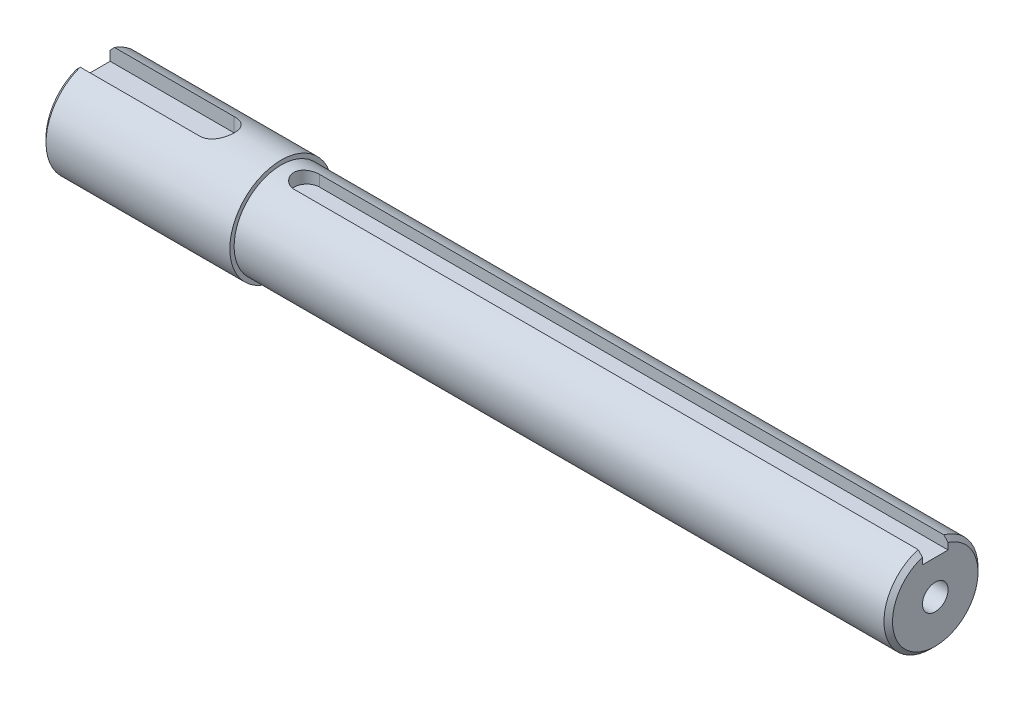
ISO-10303-21;
HEADER;
FILE_DESCRIPTION(('STEP AP214'),'2;1');
FILE_NAME('part.step','',(''),(''),'','','');
FILE_SCHEMA(('AUTOMOTIVE_DESIGN { 1 0 10303 214 1 1 1 1 }'));
ENDSEC;
DATA;
#1=APPLICATION_CONTEXT('core data for automotive mechanical design processes');
#2=APPLICATION_PROTOCOL_DEFINITION('international standard','automotive_design',2000,#1);
#3=PRODUCT_CONTEXT('',#1,'mechanical');
#4=PRODUCT('Part','Part','',(#3));
#5=PRODUCT_RELATED_PRODUCT_CATEGORY('part','',(#4));
#6=PRODUCT_DEFINITION_FORMATION('','',#4);
#7=PRODUCT_DEFINITION_CONTEXT('part definition',#1,'design');
#8=PRODUCT_DEFINITION('design','',#6,#7);
#9=PRODUCT_DEFINITION_SHAPE('','',#8);
#10=(LENGTH_UNIT() NAMED_UNIT(*) SI_UNIT(.MILLI.,.METRE.));
#11=(NAMED_UNIT(*) PLANE_ANGLE_UNIT() SI_UNIT($,.RADIAN.));
#12=(NAMED_UNIT(*) SI_UNIT($,.STERADIAN.) SOLID_ANGLE_UNIT());
#13=UNCERTAINTY_MEASURE_WITH_UNIT(LENGTH_MEASURE(1.E-05),#10,'distance_accuracy_value','');
#14=(GEOMETRIC_REPRESENTATION_CONTEXT(3) GLOBAL_UNCERTAINTY_ASSIGNED_CONTEXT((#13)) GLOBAL_UNIT_ASSIGNED_CONTEXT((#10,
#11,#12)) REPRESENTATION_CONTEXT('',''));
#15=CARTESIAN_POINT('',(0.,0.,0.));
#16=DIRECTION('',(0.,0.,1.));
#17=DIRECTION('',(1.,0.,0.));
#18=AXIS2_PLACEMENT_3D('',#15,#16,#17);
#19=CARTESIAN_POINT('',(0.,11.,0.));
#20=DIRECTION('',(1.,0.,0.));
#21=DIRECTION('',(0.,1.,0.));
#22=AXIS2_PLACEMENT_3D('',#19,#20,#21);
#23=PLANE('',#22);
#24=CARTESIAN_POINT('',(0.,0.,0.));
#25=DIRECTION('',(1.,0.,0.));
#26=DIRECTION('',(0.,1.,0.));
#27=AXIS2_PLACEMENT_3D('',#24,#25,#26);
#28=CIRCLE('',#27,3.);
#29=CARTESIAN_POINT('',(0.,3.,0.));
#30=VERTEX_POINT('',#29);
#31=EDGE_CURVE('E142',#30,#30,#28,.T.);
#32=ORIENTED_EDGE('',*,*,#31,.F.);
#33=EDGE_LOOP('',(#32));
#34=FACE_BOUND('',#33,.T.);
#35=DIRECTION('',(0.,1.,0.));
#36=VECTOR('',#35,1.);
#37=CARTESIAN_POINT('',(0.,8.00000000000001,3.00000000000002));
#38=LINE('',#37,#36);
#39=CARTESIAN_POINT('',(0.,8.00000000000001,3.00000000000002));
#40=VERTEX_POINT('',#39);
#41=CARTESIAN_POINT('',(0.,9.53939201416943,3.00000000000002));
#42=VERTEX_POINT('',#41);
#43=EDGE_CURVE('E126',#40,#42,#38,.T.);
#44=ORIENTED_EDGE('',*,*,#43,.T.);
#45=CARTESIAN_POINT('',(0.,0.,0.));
#46=DIRECTION('',(1.,0.,0.));
#47=DIRECTION('',(0.,1.,0.));
#48=AXIS2_PLACEMENT_3D('',#45,#46,#47);
#49=CIRCLE('',#48,9.99999999999998);
#50=CARTESIAN_POINT('',(0.,9.53939201416944,-2.99999999999998));
#51=VERTEX_POINT('',#50);
#52=EDGE_CURVE('E311',#42,#51,#49,.T.);
#53=ORIENTED_EDGE('',*,*,#52,.T.);
#54=DIRECTION('',(0.,1.,0.));
#55=VECTOR('',#54,1.);
#56=CARTESIAN_POINT('',(0.,8.00000000000001,-2.99999999999998));
#57=LINE('',#56,#55);
#58=CARTESIAN_POINT('',(0.,8.00000000000001,-2.99999999999998));
#59=VERTEX_POINT('',#58);
#60=EDGE_CURVE('E151',#59,#51,#57,.T.);
#61=ORIENTED_EDGE('',*,*,#60,.F.);
#62=DIRECTION('',(0.,0.,-1.));
#63=VECTOR('',#62,1.);
#64=CARTESIAN_POINT('',(0.,8.00000000000001,3.00000000000002));
#65=LINE('',#64,#63);
#66=EDGE_CURVE('E135',#40,#59,#65,.T.);
#67=ORIENTED_EDGE('',*,*,#66,.F.);
#68=EDGE_LOOP('',(#44,#53,#61,#67));
#69=FACE_BOUND('',#68,.T.);
#70=ADVANCED_FACE('F32',(#34,#69),#23,.T.);
#71=CARTESIAN_POINT('',(-197.,0.,0.));
#72=DIRECTION('',(-1.,0.,0.));
#73=DIRECTION('',(0.,-1.,0.));
#74=AXIS2_PLACEMENT_3D('',#71,#72,#73);
#75=PLANE('',#74);
#76=DIRECTION('',(0.,1.,0.));
#77=VECTOR('',#76,1.);
#78=CARTESIAN_POINT('',(-197.,7.99999999999997,-4.));
#79=LINE('',#78,#77);
#80=CARTESIAN_POINT('',(-197.,7.99999999999997,-4.));
#81=VERTEX_POINT('',#80);
#82=CARTESIAN_POINT('',(-197.,10.2469507659596,-4.));
#83=VERTEX_POINT('',#82);
#84=EDGE_CURVE('E172',#81,#83,#79,.T.);
#85=ORIENTED_EDGE('',*,*,#84,.T.);
#86=CARTESIAN_POINT('',(-197.,0.,0.));
#87=DIRECTION('',(-1.,0.,0.));
#88=DIRECTION('',(0.,-1.,0.));
#89=AXIS2_PLACEMENT_3D('',#86,#87,#88);
#90=CIRCLE('',#89,11.);
#91=CARTESIAN_POINT('',(-197.,10.2469507659596,4.));
#92=VERTEX_POINT('',#91);
#93=EDGE_CURVE('E46',#83,#92,#90,.T.);
#94=ORIENTED_EDGE('',*,*,#93,.T.);
#95=DIRECTION('',(0.,1.,0.));
#96=VECTOR('',#95,1.);
#97=CARTESIAN_POINT('',(-197.,7.99999999999997,4.));
#98=LINE('',#97,#96);
#99=CARTESIAN_POINT('',(-197.,7.99999999999997,4.));
#100=VERTEX_POINT('',#99);
#101=EDGE_CURVE('E170',#100,#92,#98,.T.);
#102=ORIENTED_EDGE('',*,*,#101,.F.);
#103=DIRECTION('',(0.,0.,1.));
#104=VECTOR('',#103,1.);
#105=CARTESIAN_POINT('',(-197.,7.99999999999997,-4.));
#106=LINE('',#105,#104);
#107=EDGE_CURVE('E160',#81,#100,#106,.T.);
#108=ORIENTED_EDGE('',*,*,#107,.F.);
#109=EDGE_LOOP('',(#85,#94,#102,#108));
#110=FACE_BOUND('',#109,.T.);
#111=ADVANCED_FACE('F236',(#110),#75,.T.);
#112=CARTESIAN_POINT('',(0.,0.,0.));
#113=DIRECTION('',(1.,0.,0.));
#114=DIRECTION('',(0.,1.,0.));
#115=AXIS2_PLACEMENT_3D('',#112,#113,#114);
#116=CYLINDRICAL_SURFACE('',#115,12.);
#117=DIRECTION('',(1.,0.,0.));
#118=VECTOR('',#117,1.);
#119=CARTESIAN_POINT('',(0.,11.3137084989848,4.00000000000002));
#120=LINE('',#119,#118);
#121=CARTESIAN_POINT('',(-196.,11.3137084989847,4.00000000000002));
#122=VERTEX_POINT('',#121);
#123=CARTESIAN_POINT('',(-167.997221426031,11.3137084989847,4.));
#124=VERTEX_POINT('',#123);
#125=EDGE_CURVE('E217',#122,#124,#120,.T.);
#126=ORIENTED_EDGE('',*,*,#125,.F.);
#127=CARTESIAN_POINT('',(-196.,0.,0.));
#128=DIRECTION('',(-1.,0.,0.));
#129=DIRECTION('',(0.,-1.,0.));
#130=AXIS2_PLACEMENT_3D('',#127,#128,#129);
#131=CIRCLE('',#130,12.);
#132=CARTESIAN_POINT('',(-196.,11.3137084989847,-4.));
#133=VERTEX_POINT('',#132);
#134=EDGE_CURVE('E264',#122,#133,#131,.F.);
#135=ORIENTED_EDGE('',*,*,#134,.T.);
#136=DIRECTION('',(1.,0.,0.));
#137=VECTOR('',#136,1.);
#138=CARTESIAN_POINT('',(0.,11.3137084989848,-4.));
#139=LINE('',#138,#137);
#140=CARTESIAN_POINT('',(-167.997220054122,11.3137084989847,-4.00000000000012));
#141=VERTEX_POINT('',#140);
#142=EDGE_CURVE('E189',#141,#133,#139,.F.);
#143=ORIENTED_EDGE('',*,*,#142,.F.);
#144=CARTESIAN_POINT('',(-167.997221426031,11.3137084989848,3.99999999999988));
#145=CARTESIAN_POINT('',(-167.888090106488,11.3136910791362,4.00001442319682));
#146=CARTESIAN_POINT('',(-167.778968514733,11.3152870758636,3.99553427080708));
#147=CARTESIAN_POINT('',(-167.561571775743,11.3215763327299,3.97769688383125));
#148=CARTESIAN_POINT('',(-167.453296407997,11.3262687567835,3.96434204554667));
#149=CARTESIAN_POINT('',(-167.238676651281,11.3386031917916,3.92891961679664));
#150=CARTESIAN_POINT('',(-167.132327504771,11.3462364527503,3.90687786843503));
#151=CARTESIAN_POINT('',(-166.92200818818,11.3642017894014,3.85430727682012));
#152=CARTESIAN_POINT('',(-166.818038104224,11.3745339626305,3.82377812683596));
#153=CARTESIAN_POINT('',(-166.510882856689,11.4091188790636,3.71986535194482));
#154=CARTESIAN_POINT('',(-166.312134708073,11.4369797092,3.63410327405976));
#155=CARTESIAN_POINT('',(-165.931818401872,11.4991523210461,3.43228529507635));
#156=CARTESIAN_POINT('',(-165.750260887349,11.5334680603617,3.31621079191059));
#157=CARTESIAN_POINT('',(-165.402352538126,11.6061786650499,3.05220889302921));
#158=CARTESIAN_POINT('',(-165.236764909265,11.6446747732985,2.90330158341943));
#159=CARTESIAN_POINT('',(-164.932393668993,11.7205537706782,2.57995430206052));
#160=CARTESIAN_POINT('',(-164.793614830528,11.7579364605799,2.4055097934559));
#161=CARTESIAN_POINT('',(-164.543303680364,11.8285550675146,2.03041609586298));
#162=CARTESIAN_POINT('',(-164.432577068633,11.8616572833476,1.82920178413627));
#163=CARTESIAN_POINT('',(-164.246851348986,11.9187841776778,1.4097184045306));
#164=CARTESIAN_POINT('',(-164.171841327038,11.9428116287148,1.19145457028982));
#165=CARTESIAN_POINT('',(-164.062277497627,11.9783627494006,0.752118908884026));
#166=CARTESIAN_POINT('',(-164.026407171149,11.9902922934759,0.531408862008694));
#167=CARTESIAN_POINT('',(-163.991954886794,12.0017443244221,0.0867973729270466));
#168=CARTESIAN_POINT('',(-163.993364043943,12.0012697676144,-0.137103296130751));
#169=CARTESIAN_POINT('',(-164.03259693882,11.988241619993,-0.572413904534736));
#170=CARTESIAN_POINT('',(-164.068990168218,11.9761625522358,-0.783969302062176));
#171=CARTESIAN_POINT('',(-164.174792564208,11.941878541528,-1.19777494078103));
#172=CARTESIAN_POINT('',(-164.2442035615,11.9196730371107,-1.40002466532908));
#173=CARTESIAN_POINT('',(-164.414904312113,11.8670269953404,-1.79260892939447));
#174=CARTESIAN_POINT('',(-164.516601364248,11.8364819827225,-1.98275175570623));
#175=CARTESIAN_POINT('',(-164.748661149424,11.7703354886693,-2.34369816422615));
#176=CARTESIAN_POINT('',(-164.879031680133,11.7347326327029,-2.51449646656923));
#177=CARTESIAN_POINT('',(-165.171894784117,11.6602521397236,-2.84038438576713));
#178=CARTESIAN_POINT('',(-165.335609036658,11.6212992344639,-2.99435851004163));
#179=CARTESIAN_POINT('',(-165.687016835815,11.5458960410484,-3.27310215297859));
#180=CARTESIAN_POINT('',(-165.874718099149,11.5094465640828,-3.39786223662125));
#181=CARTESIAN_POINT('',(-166.17193162091,11.4595761865514,-3.56109686831238));
#182=CARTESIAN_POINT('',(-166.274474056641,11.4436487055863,-3.61182291509583));
#183=CARTESIAN_POINT('',(-166.483783598967,11.4140168981015,-3.70440036952381));
#184=CARTESIAN_POINT('',(-166.590548924884,11.4003116467005,-3.74625547145216));
#185=CARTESIAN_POINT('',(-166.807435663005,11.3755874850411,-3.8206738089953));
#186=CARTESIAN_POINT('',(-166.91755327838,11.3645656541855,-3.85324715338638));
#187=CARTESIAN_POINT('',(-167.14038670142,11.3455649652074,-3.90883808557055));
#188=CARTESIAN_POINT('',(-167.253101297794,11.3375847177159,-3.93186003678465));
#189=CARTESIAN_POINT('',(-167.470861227494,11.3254693804977,-3.96661946733206));
#190=CARTESIAN_POINT('',(-167.575768551931,11.3210705609195,-3.97913364995728));
#191=CARTESIAN_POINT('',(-167.786187873259,11.3151843375549,-3.99582492918761));
#192=CARTESIAN_POINT('',(-167.891698913019,11.3136931769955,-4.0000127837681));
#193=CARTESIAN_POINT('',(-167.997220054122,11.3137084989847,-4.00000000000012));
#194=B_SPLINE_CURVE_WITH_KNOTS('',3,(#144,#145,#146,#147,#148,#149,#150,#151,#152,#153,#154,
#155,#156,#157,#158,#159,#160,#161,#162,#163,#164,#165,#166,#167,#168,#169,#170,#171,#172,#173,
#174,#175,#176,#177,#178,#179,#180,#181,#182,#183,#184,#185,#186,#187,#188,#189,#190,#191,#192,
#193),.UNSPECIFIED.,.F.,.F.,(4,2,2,2,2,2,2,2,2,2,2,2,2,2,2,2,2,2,2,2,2,2,2,2,4),(0.,
0.327273924096128,0.654459515093158,0.980679042792578,1.30691036145123,1.95841618317488,
2.61032276306354,3.28524567021812,3.96028862781627,4.6529507563251,5.34540108982523,
6.01376431370868,6.68196824523135,7.32396227493038,7.96599190471041,8.61646627274796,
9.26711775459614,9.94834762149011,10.6297971971097,10.9759537837694,11.3219659298552,
11.6675997805435,12.01307555889,12.3299374424192,12.6463896599707),.UNSPECIFIED.);
#195=EDGE_CURVE('E180',#124,#141,#194,.T.);
#196=ORIENTED_EDGE('',*,*,#195,.F.);
#197=EDGE_LOOP('',(#126,#135,#143,#196));
#198=FACE_BOUND('',#197,.T.);
#199=CARTESIAN_POINT('',(-153.,0.,0.));
#200=DIRECTION('',(1.,0.,0.));
#201=DIRECTION('',(0.,1.,0.));
#202=AXIS2_PLACEMENT_3D('',#199,#200,#201);
#203=CIRCLE('',#202,12.);
#204=CARTESIAN_POINT('',(-153.,12.,0.));
#205=VERTEX_POINT('',#204);
#206=EDGE_CURVE('E177',#205,#205,#203,.T.);
#207=ORIENTED_EDGE('',*,*,#206,.F.);
#208=EDGE_LOOP('',(#207));
#209=FACE_BOUND('',#208,.T.);
#210=ADVANCED_FACE('F191',(#198,#209),#116,.T.);
#211=CARTESIAN_POINT('',(-153.,12.,0.));
#212=DIRECTION('',(1.,0.,0.));
#213=DIRECTION('',(0.,1.,0.));
#214=AXIS2_PLACEMENT_3D('',#211,#212,#213);
#215=PLANE('',#214);
#216=ORIENTED_EDGE('',*,*,#206,.T.);
#217=EDGE_LOOP('',(#216));
#218=FACE_BOUND('',#217,.T.);
#219=CARTESIAN_POINT('',(-153.,0.,0.));
#220=DIRECTION('',(1.,0.,0.));
#221=DIRECTION('',(0.,1.,0.));
#222=AXIS2_PLACEMENT_3D('',#219,#220,#221);
#223=CIRCLE('',#222,11.);
#224=CARTESIAN_POINT('',(-153.,11.,0.));
#225=VERTEX_POINT('',#224);
#226=EDGE_CURVE('E169',#225,#225,#223,.T.);
#227=ORIENTED_EDGE('',*,*,#226,.F.);
#228=EDGE_LOOP('',(#227));
#229=FACE_BOUND('',#228,.T.);
#230=ADVANCED_FACE('F207',(#218,#229),#215,.T.);
#231=CARTESIAN_POINT('',(0.,0.,0.));
#232=DIRECTION('',(1.,0.,0.));
#233=DIRECTION('',(0.,1.,0.));
#234=AXIS2_PLACEMENT_3D('',#231,#232,#233);
#235=CYLINDRICAL_SURFACE('',#234,11.);
#236=DIRECTION('',(1.,0.,0.));
#237=VECTOR('',#236,1.);
#238=CARTESIAN_POINT('',(0.,10.5830052442584,-2.99999999999998));
#239=LINE('',#238,#237);
#240=CARTESIAN_POINT('',(-1.00000000000004,10.5830052442584,-2.99999999999998));
#241=VERTEX_POINT('',#240);
#242=CARTESIAN_POINT('',(-147.,10.5830052442584,-2.99999999999998));
#243=VERTEX_POINT('',#242);
#244=EDGE_CURVE('E313',#241,#243,#239,.F.);
#245=ORIENTED_EDGE('',*,*,#244,.F.);
#246=CARTESIAN_POINT('',(-1.00000000000004,0.,0.));
#247=DIRECTION('',(1.,0.,0.));
#248=DIRECTION('',(0.,1.,0.));
#249=AXIS2_PLACEMENT_3D('',#246,#247,#248);
#250=CIRCLE('',#249,11.);
#251=CARTESIAN_POINT('',(-1.00000000000004,10.5830052442584,3.00000000000002));
#252=VERTEX_POINT('',#251);
#253=EDGE_CURVE('E265',#241,#252,#250,.F.);
#254=ORIENTED_EDGE('',*,*,#253,.T.);
#255=DIRECTION('',(1.,0.,0.));
#256=VECTOR('',#255,1.);
#257=CARTESIAN_POINT('',(0.,10.5830052442584,3.00000000000002));
#258=LINE('',#257,#256);
#259=CARTESIAN_POINT('',(-147.,10.5830052442584,3.00000000000002));
#260=VERTEX_POINT('',#259);
#261=EDGE_CURVE('E216',#260,#252,#258,.T.);
#262=ORIENTED_EDGE('',*,*,#261,.F.);
#263=CARTESIAN_POINT('',(-147.,10.5830052442584,-2.99999999999998));
#264=CARTESIAN_POINT('',(-147.08269389141,10.5829949970026,-3.00000989976807));
#265=CARTESIAN_POINT('',(-147.165381704592,10.5839742471726,-2.99658102723593));
#266=CARTESIAN_POINT('',(-147.330133566229,10.5878356752194,-2.98292268314839));
#267=CARTESIAN_POINT('',(-147.412197731629,10.5907174869552,-2.97269452008912));
#268=CARTESIAN_POINT('',(-147.574942512145,10.598299618142,-2.94554459027319));
#269=CARTESIAN_POINT('',(-147.655625789386,10.6029958951229,-2.92863770126908));
#270=CARTESIAN_POINT('',(-147.815203254054,10.6140571066224,-2.88829120712687));
#271=CARTESIAN_POINT('',(-147.894097407408,10.6204220728906,-2.86485147768948));
#272=CARTESIAN_POINT('',(-148.127242907164,10.6417494872311,-2.78500332821791));
#273=CARTESIAN_POINT('',(-148.278139394855,10.6589535681767,-2.71903526586305));
#274=CARTESIAN_POINT('',(-148.566705341769,10.6973836998985,-2.56365897700122));
#275=CARTESIAN_POINT('',(-148.704370097104,10.7186111730805,-2.47424245636569));
#276=CARTESIAN_POINT('',(-148.966209705979,10.7633148792344,-2.27200424315803));
#277=CARTESIAN_POINT('',(-149.089991878244,10.7868322128172,-2.15868225262834));
#278=CARTESIAN_POINT('',(-149.317051438905,10.8331129950831,-1.91292298422352));
#279=CARTESIAN_POINT('',(-149.420325477293,10.8558763200935,-1.7804825894445));
#280=CARTESIAN_POINT('',(-149.605098906746,10.8985459264206,-1.49749198480949));
#281=CARTESIAN_POINT('',(-149.686203079821,10.9183977479742,-1.34667477161621));
#282=CARTESIAN_POINT('',(-149.82174841378,10.9525311229674,-1.03291980522384));
#283=CARTESIAN_POINT('',(-149.876195521132,10.9668139185607,-0.869984764533379));
#284=CARTESIAN_POINT('',(-149.955601734903,10.9879090070619,-0.540744675896701));
#285=CARTESIAN_POINT('',(-149.981234326369,10.9948916417093,-0.374613167612517));
#286=CARTESIAN_POINT('',(-150.004404664847,11.0011960589752,-0.0402673813620042));
#287=CARTESIAN_POINT('',(-150.001946716178,11.0005190152883,0.12794657356471));
#288=CARTESIAN_POINT('',(-149.969475124185,10.9917041066205,0.45698092440427));
#289=CARTESIAN_POINT('',(-149.940189973227,10.9837634920705,0.6178793089181));
#290=CARTESIAN_POINT('',(-149.856074784141,10.9615477415639,0.932383527853158));
#291=CARTESIAN_POINT('',(-149.801243508315,10.9472722986892,1.085989008539));
#292=CARTESIAN_POINT('',(-149.667045133193,10.9137016176963,1.38338788045078));
#293=CARTESIAN_POINT('',(-149.587431753761,10.8943563157114,1.52706425574146));
#294=CARTESIAN_POINT('',(-149.406120130093,10.8527253375081,1.79926098198645));
#295=CARTESIAN_POINT('',(-149.304417827188,10.830439121215,1.92777854091955));
#296=CARTESIAN_POINT('',(-149.077976764916,10.7844948742978,2.17034844112031));
#297=CARTESIAN_POINT('',(-148.952605446131,10.760815765188,2.28380693028893));
#298=CARTESIAN_POINT('',(-148.68433761913,10.7153886222241,2.48826234185509));
#299=CARTESIAN_POINT('',(-148.541436247546,10.6936411271563,2.57925300980784));
#300=CARTESIAN_POINT('',(-148.240805187246,10.6544469945806,2.73667910615424));
#301=CARTESIAN_POINT('',(-148.082975757243,10.6370325899538,2.80293223890788));
#302=CARTESIAN_POINT('',(-147.757912905473,10.6088816209578,2.90768324325782));
#303=CARTESIAN_POINT('',(-147.590694057725,10.598135003286,2.94622291362361));
#304=CARTESIAN_POINT('',(-147.351645560133,10.588613232355,2.98015870664209));
#305=CARTESIAN_POINT('',(-147.281483540276,10.5865140551644,2.98759962141263));
#306=CARTESIAN_POINT('',(-147.14089244676,10.58371035186,2.99751512863223));
#307=CARTESIAN_POINT('',(-147.070463964941,10.5830036423878,2.99999749605759));
#308=CARTESIAN_POINT('',(-147.,10.5830052442583,3.00000000000002));
#309=B_SPLINE_CURVE_WITH_KNOTS('',3,(#263,#264,#265,#266,#267,#268,#269,#270,#271,#272,#273,
#274,#275,#276,#277,#278,#279,#280,#281,#282,#283,#284,#285,#286,#287,#288,#289,#290,#291,#292,
#293,#294,#295,#296,#297,#298,#299,#300,#301,#302,#303,#304,#305,#306,#307,#308),.UNSPECIFIED.,
.F.,.F.,(4,2,2,2,2,2,2,2,2,2,2,2,2,2,2,2,2,2,2,2,2,2,4),(0.,0.247994395628672,0.49594107954413,
0.743338515979064,0.99074065992621,1.48499724217185,1.97942888795734,2.4854708385663,
2.99159538337128,3.50622794981869,4.02074566333959,4.52296979924473,5.02511698025349,
5.51402000992994,6.00294672920887,6.49689640600088,6.99093691914145,7.50077286033221,
8.01075056671348,8.5244155087371,9.0373040824346,9.24891043373588,9.46018472611219),.UNSPECIFIED.);
#310=EDGE_CURVE('E122',#243,#260,#309,.T.);
#311=ORIENTED_EDGE('',*,*,#310,.F.);
#312=EDGE_LOOP('',(#245,#254,#262,#311));
#313=FACE_BOUND('',#312,.T.);
#314=ORIENTED_EDGE('',*,*,#226,.T.);
#315=EDGE_LOOP('',(#314));
#316=FACE_BOUND('',#315,.T.);
#317=ADVANCED_FACE('F201',(#313,#316),#235,.T.);
#318=CARTESIAN_POINT('',(-167.997220054122,7.99999999999998,0.));
#319=DIRECTION('',(0.,1.,0.));
#320=DIRECTION('',(-1.,0.,0.));
#321=AXIS2_PLACEMENT_3D('',#318,#319,#320);
#322=CYLINDRICAL_SURFACE('',#321,4.00000000000012);
#323=DIRECTION('',(0.,1.,0.));
#324=VECTOR('',#323,1.);
#325=CARTESIAN_POINT('',(-167.997221426031,7.99999999999998,4.));
#326=LINE('',#325,#324);
#327=CARTESIAN_POINT('',(-167.997221426031,7.99999999999998,4.));
#328=VERTEX_POINT('',#327);
#329=EDGE_CURVE('E166',#328,#124,#326,.T.);
#330=ORIENTED_EDGE('',*,*,#329,.T.);
#331=ORIENTED_EDGE('',*,*,#195,.T.);
#332=DIRECTION('',(0.,1.,0.));
#333=VECTOR('',#332,1.);
#334=CARTESIAN_POINT('',(-167.997220054122,7.99999999999998,-4.));
#335=LINE('',#334,#333);
#336=CARTESIAN_POINT('',(-167.997220054122,7.99999999999998,-4.));
#337=VERTEX_POINT('',#336);
#338=EDGE_CURVE('E165',#337,#141,#335,.T.);
#339=ORIENTED_EDGE('',*,*,#338,.F.);
#340=CARTESIAN_POINT('',(-167.997220054122,7.99999999999998,0.));
#341=DIRECTION('',(0.,1.,0.));
#342=DIRECTION('',(1.,0.,0.));
#343=AXIS2_PLACEMENT_3D('',#340,#341,#342);
#344=CIRCLE('',#343,4.00000000000012);
#345=EDGE_CURVE('E150',#328,#337,#344,.T.);
#346=ORIENTED_EDGE('',*,*,#345,.F.);
#347=EDGE_LOOP('',(#330,#331,#339,#346));
#348=FACE_BOUND('',#347,.T.);
#349=ADVANCED_FACE('F195',(#348),#322,.F.);
#350=CARTESIAN_POINT('',(-197.,7.99999999999997,4.));
#351=DIRECTION('',(0.,0.,1.));
#352=DIRECTION('',(1.,0.,0.));
#353=AXIS2_PLACEMENT_3D('',#350,#351,#352);
#354=PLANE('',#353);
#355=ORIENTED_EDGE('',*,*,#101,.T.);
#356=CARTESIAN_POINT('',(-197.,10.2469507659596,4.));
#357=CARTESIAN_POINT('',(-196.833865477622,10.4252425966776,4.));
#358=CARTESIAN_POINT('',(-196.667464874957,10.6032849984223,4.));
#359=CARTESIAN_POINT('',(-196.33413154152,10.9588709093335,4.));
#360=CARTESIAN_POINT('',(-196.167198810851,11.1364144185972,4.));
#361=CARTESIAN_POINT('',(-196.,11.3137084989847,4.));
#362=B_SPLINE_CURVE_WITH_KNOTS('',3,(#356,#357,#358,#359,#360,#361),.UNSPECIFIED.,.F.,.F.,(4,2,
4),(0.,0.731091182052444,1.46218222169954),.UNSPECIFIED.);
#363=EDGE_CURVE('E11',#92,#122,#362,.T.);
#364=ORIENTED_EDGE('',*,*,#363,.T.);
#365=ORIENTED_EDGE('',*,*,#125,.T.);
#366=ORIENTED_EDGE('',*,*,#329,.F.);
#367=DIRECTION('',(1.,0.,0.));
#368=VECTOR('',#367,1.);
#369=CARTESIAN_POINT('',(-197.,7.99999999999997,4.));
#370=LINE('',#369,#368);
#371=EDGE_CURVE('E162',#100,#328,#370,.T.);
#372=ORIENTED_EDGE('',*,*,#371,.F.);
#373=EDGE_LOOP('',(#355,#364,#365,#366,#372));
#374=FACE_BOUND('',#373,.T.);
#375=ADVANCED_FACE('F200',(#374),#354,.F.);
#376=CARTESIAN_POINT('',(-167.997220054122,7.99999999999998,-4.));
#377=DIRECTION('',(0.,0.,-1.));
#378=DIRECTION('',(-1.,0.,0.));
#379=AXIS2_PLACEMENT_3D('',#376,#377,#378);
#380=PLANE('',#379);
#381=ORIENTED_EDGE('',*,*,#142,.T.);
#382=CARTESIAN_POINT('',(-196.,11.3137084989847,-4.));
#383=CARTESIAN_POINT('',(-196.167198810851,11.1364144185972,-4.));
#384=CARTESIAN_POINT('',(-196.33413154152,10.9588709093335,-4.));
#385=CARTESIAN_POINT('',(-196.667464874957,10.6032849984223,-4.));
#386=CARTESIAN_POINT('',(-196.833865477622,10.4252425966776,-4.));
#387=CARTESIAN_POINT('',(-197.,10.2469507659596,-4.));
#388=B_SPLINE_CURVE_WITH_KNOTS('',3,(#382,#383,#384,#385,#386,#387),.UNSPECIFIED.,.F.,.F.,(4,2,
4),(0.,0.731091039647097,1.46218222169954),.UNSPECIFIED.);
#389=EDGE_CURVE('E60',#133,#83,#388,.T.);
#390=ORIENTED_EDGE('',*,*,#389,.T.);
#391=ORIENTED_EDGE('',*,*,#84,.F.);
#392=DIRECTION('',(-1.,0.,0.));
#393=VECTOR('',#392,1.);
#394=CARTESIAN_POINT('',(-167.997220054122,7.99999999999998,-4.));
#395=LINE('',#394,#393);
#396=EDGE_CURVE('E157',#337,#81,#395,.T.);
#397=ORIENTED_EDGE('',*,*,#396,.F.);
#398=ORIENTED_EDGE('',*,*,#338,.T.);
#399=EDGE_LOOP('',(#381,#390,#391,#397,#398));
#400=FACE_BOUND('',#399,.T.);
#401=ADVANCED_FACE('F203',(#400),#380,.F.);
#402=CARTESIAN_POINT('',(-167.997220054122,7.99999999999998,0.));
#403=DIRECTION('',(0.,-1.,0.));
#404=DIRECTION('',(1.,0.,0.));
#405=AXIS2_PLACEMENT_3D('',#402,#403,#404);
#406=PLANE('',#405);
#407=ORIENTED_EDGE('',*,*,#345,.T.);
#408=ORIENTED_EDGE('',*,*,#396,.T.);
#409=ORIENTED_EDGE('',*,*,#107,.T.);
#410=ORIENTED_EDGE('',*,*,#371,.T.);
#411=EDGE_LOOP('',(#407,#408,#409,#410));
#412=FACE_BOUND('',#411,.T.);
#413=ADVANCED_FACE('F224',(#412),#406,.F.);
#414=CARTESIAN_POINT('',(-147.,7.99999999999999,0.));
#415=DIRECTION('',(0.,1.,0.));
#416=DIRECTION('',(-1.,0.,0.));
#417=AXIS2_PLACEMENT_3D('',#414,#415,#416);
#418=CYLINDRICAL_SURFACE('',#417,3.);
#419=DIRECTION('',(0.,1.,0.));
#420=VECTOR('',#419,1.);
#421=CARTESIAN_POINT('',(-147.,7.99999999999999,-2.99999999999998));
#422=LINE('',#421,#420);
#423=CARTESIAN_POINT('',(-147.,7.99999999999999,-2.99999999999998));
#424=VERTEX_POINT('',#423);
#425=EDGE_CURVE('E148',#424,#243,#422,.T.);
#426=ORIENTED_EDGE('',*,*,#425,.T.);
#427=ORIENTED_EDGE('',*,*,#310,.T.);
#428=DIRECTION('',(0.,1.,0.));
#429=VECTOR('',#428,1.);
#430=CARTESIAN_POINT('',(-147.,7.99999999999999,3.00000000000002));
#431=LINE('',#430,#429);
#432=CARTESIAN_POINT('',(-147.,7.99999999999999,3.00000000000002));
#433=VERTEX_POINT('',#432);
#434=EDGE_CURVE('E114',#433,#260,#431,.T.);
#435=ORIENTED_EDGE('',*,*,#434,.F.);
#436=CARTESIAN_POINT('',(-147.,7.99999999999999,0.));
#437=DIRECTION('',(0.,1.,0.));
#438=DIRECTION('',(-1.,0.,0.));
#439=AXIS2_PLACEMENT_3D('',#436,#437,#438);
#440=CIRCLE('',#439,3.);
#441=EDGE_CURVE('E119',#424,#433,#440,.T.);
#442=ORIENTED_EDGE('',*,*,#441,.F.);
#443=EDGE_LOOP('',(#426,#427,#435,#442));
#444=FACE_BOUND('',#443,.T.);
#445=ADVANCED_FACE('F117',(#444),#418,.F.);
#446=CARTESIAN_POINT('',(-147.,7.99999999999999,-2.99999999999998));
#447=DIRECTION('',(0.,0.,-1.));
#448=DIRECTION('',(-1.,0.,0.));
#449=AXIS2_PLACEMENT_3D('',#446,#447,#448);
#450=PLANE('',#449);
#451=ORIENTED_EDGE('',*,*,#60,.T.);
#452=CARTESIAN_POINT('',(0.,9.53939201416944,-2.99999999999998));
#453=CARTESIAN_POINT('',(-0.16629790068698,9.71368092539931,-2.99999999999998));
#454=CARTESIAN_POINT('',(-0.332780188833613,9.88779315483331,-2.99999999999998));
#455=CARTESIAN_POINT('',(-0.666113522206432,10.2356642314918,-2.99999999999998));
#456=CARTESIAN_POINT('',(-0.832964567393146,10.4094230787541,-2.99999999999998));
#457=CARTESIAN_POINT('',(-1.00000000000004,10.5830052442584,-2.99999999999998));
#458=B_SPLINE_CURVE_WITH_KNOTS('',3,(#452,#453,#454,#455,#456,#457),.UNSPECIFIED.,.F.,.F.,(4,2,
4),(0.,0.722691349294542,1.44538262123327),.UNSPECIFIED.);
#459=EDGE_CURVE('E250',#51,#241,#458,.T.);
#460=ORIENTED_EDGE('',*,*,#459,.T.);
#461=ORIENTED_EDGE('',*,*,#244,.T.);
#462=ORIENTED_EDGE('',*,*,#425,.F.);
#463=DIRECTION('',(-1.,0.,0.));
#464=VECTOR('',#463,1.);
#465=CARTESIAN_POINT('',(-147.,7.99999999999999,-2.99999999999998));
#466=LINE('',#465,#464);
#467=EDGE_CURVE('E127',#59,#424,#466,.T.);
#468=ORIENTED_EDGE('',*,*,#467,.F.);
#469=EDGE_LOOP('',(#451,#460,#461,#462,#468));
#470=FACE_BOUND('',#469,.T.);
#471=ADVANCED_FACE('F223',(#470),#450,.F.);
#472=CARTESIAN_POINT('',(-147.,7.99999999999999,3.00000000000002));
#473=DIRECTION('',(0.,0.,1.));
#474=DIRECTION('',(1.,0.,0.));
#475=AXIS2_PLACEMENT_3D('',#472,#473,#474);
#476=PLANE('',#475);
#477=ORIENTED_EDGE('',*,*,#261,.T.);
#478=CARTESIAN_POINT('',(-1.00000000000004,10.5830052442584,3.00000000000002));
#479=CARTESIAN_POINT('',(-0.832964567393147,10.4094230787541,3.00000000000002));
#480=CARTESIAN_POINT('',(-0.666113522206434,10.2356642314918,3.00000000000002));
#481=CARTESIAN_POINT('',(-0.332780188833613,9.8877931548333,3.00000000000002));
#482=CARTESIAN_POINT('',(-0.16629790068698,9.7136809253993,3.00000000000002));
#483=CARTESIAN_POINT('',(0.,9.53939201416943,3.00000000000002));
#484=B_SPLINE_CURVE_WITH_KNOTS('',3,(#478,#479,#480,#481,#482,#483),.UNSPECIFIED.,.F.,.F.,(4,2,
4),(0.,0.72269127193873,1.44538262123327),.UNSPECIFIED.);
#485=EDGE_CURVE('E258',#252,#42,#484,.T.);
#486=ORIENTED_EDGE('',*,*,#485,.T.);
#487=ORIENTED_EDGE('',*,*,#43,.F.);
#488=DIRECTION('',(1.,0.,0.));
#489=VECTOR('',#488,1.);
#490=CARTESIAN_POINT('',(-147.,7.99999999999999,3.00000000000002));
#491=LINE('',#490,#489);
#492=EDGE_CURVE('E130',#433,#40,#491,.T.);
#493=ORIENTED_EDGE('',*,*,#492,.F.);
#494=ORIENTED_EDGE('',*,*,#434,.T.);
#495=EDGE_LOOP('',(#477,#486,#487,#493,#494));
#496=FACE_BOUND('',#495,.T.);
#497=ADVANCED_FACE('F131',(#496),#476,.F.);
#498=CARTESIAN_POINT('',(-147.,7.99999999999999,0.));
#499=DIRECTION('',(0.,1.,0.));
#500=DIRECTION('',(-1.,0.,0.));
#501=AXIS2_PLACEMENT_3D('',#498,#499,#500);
#502=PLANE('',#501);
#503=ORIENTED_EDGE('',*,*,#441,.T.);
#504=ORIENTED_EDGE('',*,*,#492,.T.);
#505=ORIENTED_EDGE('',*,*,#66,.T.);
#506=ORIENTED_EDGE('',*,*,#467,.T.);
#507=EDGE_LOOP('',(#503,#504,#505,#506));
#508=FACE_BOUND('',#507,.T.);
#509=ADVANCED_FACE('F137',(#508),#502,.T.);
#510=CARTESIAN_POINT('',(0.,0.,0.));
#511=DIRECTION('',(-1.,0.,0.));
#512=DIRECTION('',(0.,-1.,0.));
#513=AXIS2_PLACEMENT_3D('',#510,#511,#512);
#514=CONICAL_SURFACE('',#513,9.99999999999998,0.785398163397443);
#515=ORIENTED_EDGE('',*,*,#485,.F.);
#516=ORIENTED_EDGE('',*,*,#253,.F.);
#517=ORIENTED_EDGE('',*,*,#459,.F.);
#518=ORIENTED_EDGE('',*,*,#52,.F.);
#519=EDGE_LOOP('',(#515,#516,#517,#518));
#520=FACE_BOUND('',#519,.T.);
#521=ADVANCED_FACE('F244',(#520),#514,.T.);
#522=CARTESIAN_POINT('',(-196.,0.,0.));
#523=DIRECTION('',(1.,0.,0.));
#524=DIRECTION('',(0.,1.,0.));
#525=AXIS2_PLACEMENT_3D('',#522,#523,#524);
#526=CONICAL_SURFACE('',#525,12.,0.78539816339744);
#527=ORIENTED_EDGE('',*,*,#363,.F.);
#528=ORIENTED_EDGE('',*,*,#93,.F.);
#529=ORIENTED_EDGE('',*,*,#389,.F.);
#530=ORIENTED_EDGE('',*,*,#134,.F.);
#531=EDGE_LOOP('',(#527,#528,#529,#530));
#532=FACE_BOUND('',#531,.T.);
#533=ADVANCED_FACE('F34',(#532),#526,.T.);
#534=CARTESIAN_POINT('',(-20.,0.,0.));
#535=DIRECTION('',(1.,0.,0.));
#536=DIRECTION('',(0.,1.,0.));
#537=AXIS2_PLACEMENT_3D('',#534,#535,#536);
#538=CYLINDRICAL_SURFACE('',#537,3.);
#539=CARTESIAN_POINT('',(-20.,0.,0.));
#540=DIRECTION('',(1.,0.,0.));
#541=DIRECTION('',(0.,1.,0.));
#542=AXIS2_PLACEMENT_3D('',#539,#540,#541);
#543=CIRCLE('',#542,3.);
#544=CARTESIAN_POINT('',(-20.,3.,0.));
#545=VERTEX_POINT('',#544);
#546=EDGE_CURVE('E139',#545,#545,#543,.T.);
#547=ORIENTED_EDGE('',*,*,#546,.F.);
#548=EDGE_LOOP('',(#547));
#549=FACE_BOUND('',#548,.T.);
#550=ORIENTED_EDGE('',*,*,#31,.T.);
#551=EDGE_LOOP('',(#550));
#552=FACE_BOUND('',#551,.T.);
#553=ADVANCED_FACE('F285',(#549,#552),#538,.F.);
#554=CARTESIAN_POINT('',(-20.,0.,0.));
#555=DIRECTION('',(1.,0.,0.));
#556=DIRECTION('',(0.,1.,0.));
#557=AXIS2_PLACEMENT_3D('',#554,#555,#556);
#558=PLANE('',#557);
#559=ORIENTED_EDGE('',*,*,#546,.T.);
#560=EDGE_LOOP('',(#559));
#561=FACE_BOUND('',#560,.T.);
#562=ADVANCED_FACE('F289',(#561),#558,.T.);
#563=CLOSED_SHELL('',(#70,#111,#210,#230,#317,#349,#375,#401,#413,#445,#471,#497,#509,#521,#533,
#553,#562));
#564=MANIFOLD_SOLID_BREP('B2',#563);
#565=ADVANCED_BREP_SHAPE_REPRESENTATION('',(#18,#564),#14);
#566=SHAPE_DEFINITION_REPRESENTATION(#9,#565);
ENDSEC;
END-ISO-10303-21;
